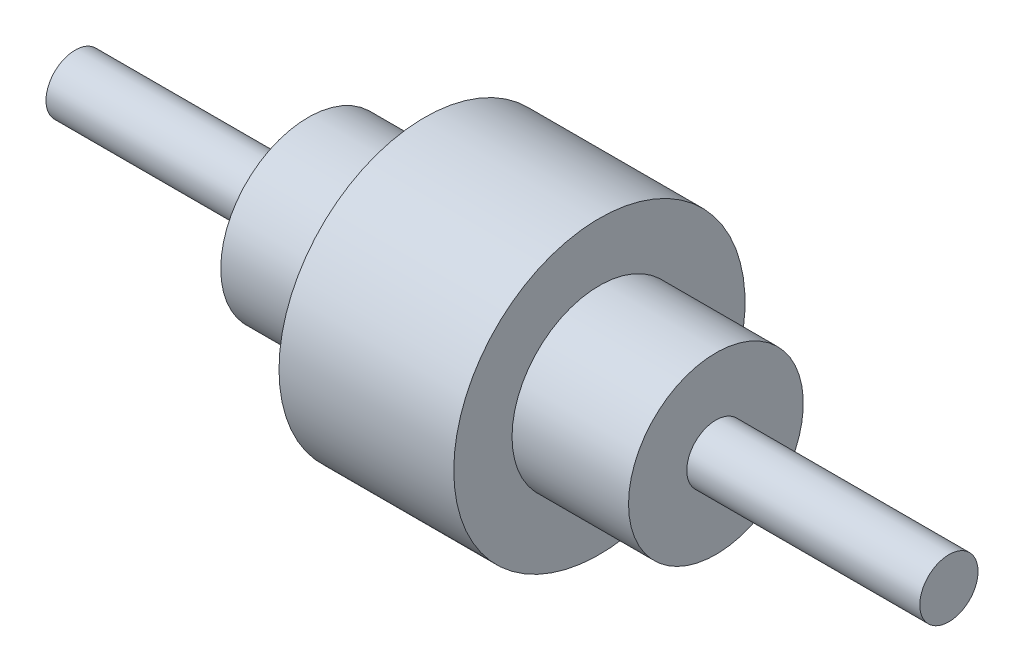
ISO-10303-21;
HEADER;
FILE_DESCRIPTION(('STEP AP214'),'2;1');
FILE_NAME('part.step','',(''),(''),'','','');
FILE_SCHEMA(('AUTOMOTIVE_DESIGN { 1 0 10303 214 1 1 1 1 }'));
ENDSEC;
DATA;
#1=APPLICATION_CONTEXT('core data for automotive mechanical design processes');
#2=APPLICATION_PROTOCOL_DEFINITION('international standard','automotive_design',2000,#1);
#3=PRODUCT_CONTEXT('',#1,'mechanical');
#4=PRODUCT('Part','Part','',(#3));
#5=PRODUCT_RELATED_PRODUCT_CATEGORY('part','',(#4));
#6=PRODUCT_DEFINITION_FORMATION('','',#4);
#7=PRODUCT_DEFINITION_CONTEXT('part definition',#1,'design');
#8=PRODUCT_DEFINITION('design','',#6,#7);
#9=PRODUCT_DEFINITION_SHAPE('','',#8);
#10=(LENGTH_UNIT() NAMED_UNIT(*) SI_UNIT(.MILLI.,.METRE.));
#11=(NAMED_UNIT(*) PLANE_ANGLE_UNIT() SI_UNIT($,.RADIAN.));
#12=(NAMED_UNIT(*) SI_UNIT($,.STERADIAN.) SOLID_ANGLE_UNIT());
#13=UNCERTAINTY_MEASURE_WITH_UNIT(LENGTH_MEASURE(1.E-05),#10,'distance_accuracy_value','');
#14=(GEOMETRIC_REPRESENTATION_CONTEXT(3) GLOBAL_UNCERTAINTY_ASSIGNED_CONTEXT((#13)) GLOBAL_UNIT_ASSIGNED_CONTEXT((#10,
#11,#12)) REPRESENTATION_CONTEXT('',''));
#15=CARTESIAN_POINT('',(0.,0.,0.));
#16=DIRECTION('',(0.,0.,1.));
#17=DIRECTION('',(1.,0.,0.));
#18=AXIS2_PLACEMENT_3D('',#15,#16,#17);
#19=CARTESIAN_POINT('',(0.,0.,0.));
#20=DIRECTION('',(1.,0.,0.));
#21=DIRECTION('',(0.,0.,-1.));
#22=AXIS2_PLACEMENT_3D('',#19,#20,#21);
#23=PLANE('',#22);
#24=CARTESIAN_POINT('',(0.,0.,0.));
#25=DIRECTION('',(-1.,0.,0.));
#26=DIRECTION('',(0.,0.,1.));
#27=AXIS2_PLACEMENT_3D('',#24,#25,#26);
#28=CIRCLE('',#27,254.);
#29=CARTESIAN_POINT('',(0.,0.,254.));
#30=VERTEX_POINT('',#29);
#31=EDGE_CURVE('E10',#30,#30,#28,.T.);
#32=ORIENTED_EDGE('',*,*,#31,.T.);
#33=EDGE_LOOP('',(#32));
#34=FACE_BOUND('',#33,.T.);
#35=ADVANCED_FACE('F31',(#34),#23,.F.);
#36=CARTESIAN_POINT('',(0.,0.,0.));
#37=DIRECTION('',(-1.,0.,0.));
#38=DIRECTION('',(0.,0.,1.));
#39=AXIS2_PLACEMENT_3D('',#36,#37,#38);
#40=CYLINDRICAL_SURFACE('',#39,254.);
#41=ORIENTED_EDGE('',*,*,#31,.F.);
#42=EDGE_LOOP('',(#41));
#43=FACE_BOUND('',#42,.T.);
#44=CARTESIAN_POINT('',(2032.,0.,0.));
#45=DIRECTION('',(-1.,0.,0.));
#46=DIRECTION('',(0.,0.,1.));
#47=AXIS2_PLACEMENT_3D('',#44,#45,#46);
#48=CIRCLE('',#47,254.);
#49=CARTESIAN_POINT('',(2032.,0.,254.));
#50=VERTEX_POINT('',#49);
#51=EDGE_CURVE('E37',#50,#50,#48,.T.);
#52=ORIENTED_EDGE('',*,*,#51,.T.);
#53=EDGE_LOOP('',(#52));
#54=FACE_BOUND('',#53,.T.);
#55=ADVANCED_FACE('F81',(#43,#54),#40,.T.);
#56=CARTESIAN_POINT('',(2032.,254.,0.));
#57=DIRECTION('',(1.,0.,0.));
#58=DIRECTION('',(0.,0.,-1.));
#59=AXIS2_PLACEMENT_3D('',#56,#57,#58);
#60=PLANE('',#59);
#61=ORIENTED_EDGE('',*,*,#51,.F.);
#62=EDGE_LOOP('',(#61));
#63=FACE_BOUND('',#62,.T.);
#64=CARTESIAN_POINT('',(2032.,0.,0.));
#65=DIRECTION('',(-1.,0.,0.));
#66=DIRECTION('',(0.,0.,1.));
#67=AXIS2_PLACEMENT_3D('',#64,#65,#66);
#68=CIRCLE('',#67,762.);
#69=CARTESIAN_POINT('',(2032.,0.,762.));
#70=VERTEX_POINT('',#69);
#71=EDGE_CURVE('E41',#70,#70,#68,.T.);
#72=ORIENTED_EDGE('',*,*,#71,.T.);
#73=EDGE_LOOP('',(#72));
#74=FACE_BOUND('',#73,.T.);
#75=ADVANCED_FACE('F85',(#63,#74),#60,.F.);
#76=CARTESIAN_POINT('',(0.,0.,0.));
#77=DIRECTION('',(-1.,0.,0.));
#78=DIRECTION('',(0.,0.,1.));
#79=AXIS2_PLACEMENT_3D('',#76,#77,#78);
#80=CYLINDRICAL_SURFACE('',#79,762.);
#81=ORIENTED_EDGE('',*,*,#71,.F.);
#82=EDGE_LOOP('',(#81));
#83=FACE_BOUND('',#82,.T.);
#84=CARTESIAN_POINT('',(3048.,0.,0.));
#85=DIRECTION('',(-1.,0.,0.));
#86=DIRECTION('',(0.,0.,1.));
#87=AXIS2_PLACEMENT_3D('',#84,#85,#86);
#88=CIRCLE('',#87,762.);
#89=CARTESIAN_POINT('',(3048.,0.,762.));
#90=VERTEX_POINT('',#89);
#91=EDGE_CURVE('E45',#90,#90,#88,.T.);
#92=ORIENTED_EDGE('',*,*,#91,.T.);
#93=EDGE_LOOP('',(#92));
#94=FACE_BOUND('',#93,.T.);
#95=ADVANCED_FACE('F90',(#83,#94),#80,.T.);
#96=CARTESIAN_POINT('',(3048.,762.,0.));
#97=DIRECTION('',(1.,0.,0.));
#98=DIRECTION('',(0.,0.,-1.));
#99=AXIS2_PLACEMENT_3D('',#96,#97,#98);
#100=PLANE('',#99);
#101=ORIENTED_EDGE('',*,*,#91,.F.);
#102=EDGE_LOOP('',(#101));
#103=FACE_BOUND('',#102,.T.);
#104=CARTESIAN_POINT('',(3048.,0.,0.));
#105=DIRECTION('',(-1.,0.,0.));
#106=DIRECTION('',(0.,0.,1.));
#107=AXIS2_PLACEMENT_3D('',#104,#105,#106);
#108=CIRCLE('',#107,1270.);
#109=CARTESIAN_POINT('',(3048.,0.,1270.));
#110=VERTEX_POINT('',#109);
#111=EDGE_CURVE('E50',#110,#110,#108,.T.);
#112=ORIENTED_EDGE('',*,*,#111,.T.);
#113=EDGE_LOOP('',(#112));
#114=FACE_BOUND('',#113,.T.);
#115=ADVANCED_FACE('F96',(#103,#114),#100,.F.);
#116=CARTESIAN_POINT('',(0.,0.,0.));
#117=DIRECTION('',(-1.,0.,0.));
#118=DIRECTION('',(0.,0.,1.));
#119=AXIS2_PLACEMENT_3D('',#116,#117,#118);
#120=CYLINDRICAL_SURFACE('',#119,1270.);
#121=ORIENTED_EDGE('',*,*,#111,.F.);
#122=EDGE_LOOP('',(#121));
#123=FACE_BOUND('',#122,.T.);
#124=CARTESIAN_POINT('',(4572.,0.,0.));
#125=DIRECTION('',(-1.,0.,0.));
#126=DIRECTION('',(0.,0.,1.));
#127=AXIS2_PLACEMENT_3D('',#124,#125,#126);
#128=CIRCLE('',#127,1270.);
#129=CARTESIAN_POINT('',(4572.,0.,1270.));
#130=VERTEX_POINT('',#129);
#131=EDGE_CURVE('E53',#130,#130,#128,.T.);
#132=ORIENTED_EDGE('',*,*,#131,.T.);
#133=EDGE_LOOP('',(#132));
#134=FACE_BOUND('',#133,.T.);
#135=ADVANCED_FACE('F100',(#123,#134),#120,.T.);
#136=CARTESIAN_POINT('',(4572.,762.,0.));
#137=DIRECTION('',(-1.,0.,0.));
#138=DIRECTION('',(0.,0.,1.));
#139=AXIS2_PLACEMENT_3D('',#136,#137,#138);
#140=PLANE('',#139);
#141=ORIENTED_EDGE('',*,*,#131,.F.);
#142=EDGE_LOOP('',(#141));
#143=FACE_BOUND('',#142,.T.);
#144=CARTESIAN_POINT('',(4572.,0.,0.));
#145=DIRECTION('',(-1.,0.,0.));
#146=DIRECTION('',(0.,0.,1.));
#147=AXIS2_PLACEMENT_3D('',#144,#145,#146);
#148=CIRCLE('',#147,762.);
#149=CARTESIAN_POINT('',(4572.,0.,762.));
#150=VERTEX_POINT('',#149);
#151=EDGE_CURVE('E56',#150,#150,#148,.T.);
#152=ORIENTED_EDGE('',*,*,#151,.T.);
#153=EDGE_LOOP('',(#152));
#154=FACE_BOUND('',#153,.T.);
#155=ADVANCED_FACE('F104',(#143,#154),#140,.F.);
#156=CARTESIAN_POINT('',(0.,0.,0.));
#157=DIRECTION('',(-1.,0.,0.));
#158=DIRECTION('',(0.,0.,1.));
#159=AXIS2_PLACEMENT_3D('',#156,#157,#158);
#160=CYLINDRICAL_SURFACE('',#159,762.);
#161=ORIENTED_EDGE('',*,*,#151,.F.);
#162=EDGE_LOOP('',(#161));
#163=FACE_BOUND('',#162,.T.);
#164=CARTESIAN_POINT('',(5588.,0.,0.));
#165=DIRECTION('',(-1.,0.,0.));
#166=DIRECTION('',(0.,0.,1.));
#167=AXIS2_PLACEMENT_3D('',#164,#165,#166);
#168=CIRCLE('',#167,762.);
#169=CARTESIAN_POINT('',(5588.,0.,762.));
#170=VERTEX_POINT('',#169);
#171=EDGE_CURVE('E59',#170,#170,#168,.T.);
#172=ORIENTED_EDGE('',*,*,#171,.T.);
#173=EDGE_LOOP('',(#172));
#174=FACE_BOUND('',#173,.T.);
#175=ADVANCED_FACE('F108',(#163,#174),#160,.T.);
#176=CARTESIAN_POINT('',(5588.,254.,0.));
#177=DIRECTION('',(-1.,0.,0.));
#178=DIRECTION('',(0.,0.,1.));
#179=AXIS2_PLACEMENT_3D('',#176,#177,#178);
#180=PLANE('',#179);
#181=ORIENTED_EDGE('',*,*,#171,.F.);
#182=EDGE_LOOP('',(#181));
#183=FACE_BOUND('',#182,.T.);
#184=CARTESIAN_POINT('',(5588.,0.,0.));
#185=DIRECTION('',(-1.,0.,0.));
#186=DIRECTION('',(0.,0.,1.));
#187=AXIS2_PLACEMENT_3D('',#184,#185,#186);
#188=CIRCLE('',#187,254.);
#189=CARTESIAN_POINT('',(5588.,0.,254.));
#190=VERTEX_POINT('',#189);
#191=EDGE_CURVE('E62',#190,#190,#188,.T.);
#192=ORIENTED_EDGE('',*,*,#191,.T.);
#193=EDGE_LOOP('',(#192));
#194=FACE_BOUND('',#193,.T.);
#195=ADVANCED_FACE('F77',(#183,#194),#180,.F.);
#196=CARTESIAN_POINT('',(0.,0.,0.));
#197=DIRECTION('',(-1.,0.,0.));
#198=DIRECTION('',(0.,0.,1.));
#199=AXIS2_PLACEMENT_3D('',#196,#197,#198);
#200=CYLINDRICAL_SURFACE('',#199,254.);
#201=ORIENTED_EDGE('',*,*,#191,.F.);
#202=EDGE_LOOP('',(#201));
#203=FACE_BOUND('',#202,.T.);
#204=CARTESIAN_POINT('',(7620.,0.,0.));
#205=DIRECTION('',(-1.,0.,0.));
#206=DIRECTION('',(0.,0.,1.));
#207=AXIS2_PLACEMENT_3D('',#204,#205,#206);
#208=CIRCLE('',#207,254.);
#209=CARTESIAN_POINT('',(7620.,0.,254.));
#210=VERTEX_POINT('',#209);
#211=EDGE_CURVE('E65',#210,#210,#208,.T.);
#212=ORIENTED_EDGE('',*,*,#211,.T.);
#213=EDGE_LOOP('',(#212));
#214=FACE_BOUND('',#213,.T.);
#215=ADVANCED_FACE('F69',(#203,#214),#200,.T.);
#216=CARTESIAN_POINT('',(7620.,0.,0.));
#217=DIRECTION('',(-1.,0.,0.));
#218=DIRECTION('',(0.,0.,1.));
#219=AXIS2_PLACEMENT_3D('',#216,#217,#218);
#220=PLANE('',#219);
#221=ORIENTED_EDGE('',*,*,#211,.F.);
#222=EDGE_LOOP('',(#221));
#223=FACE_BOUND('',#222,.T.);
#224=ADVANCED_FACE('F71',(#223),#220,.F.);
#225=CLOSED_SHELL('',(#35,#55,#75,#95,#115,#135,#155,#175,#195,#215,#224));
#226=MANIFOLD_SOLID_BREP('B2',#225);
#227=ADVANCED_BREP_SHAPE_REPRESENTATION('',(#18,#226),#14);
#228=SHAPE_DEFINITION_REPRESENTATION(#9,#227);
ENDSEC;
END-ISO-10303-21;
